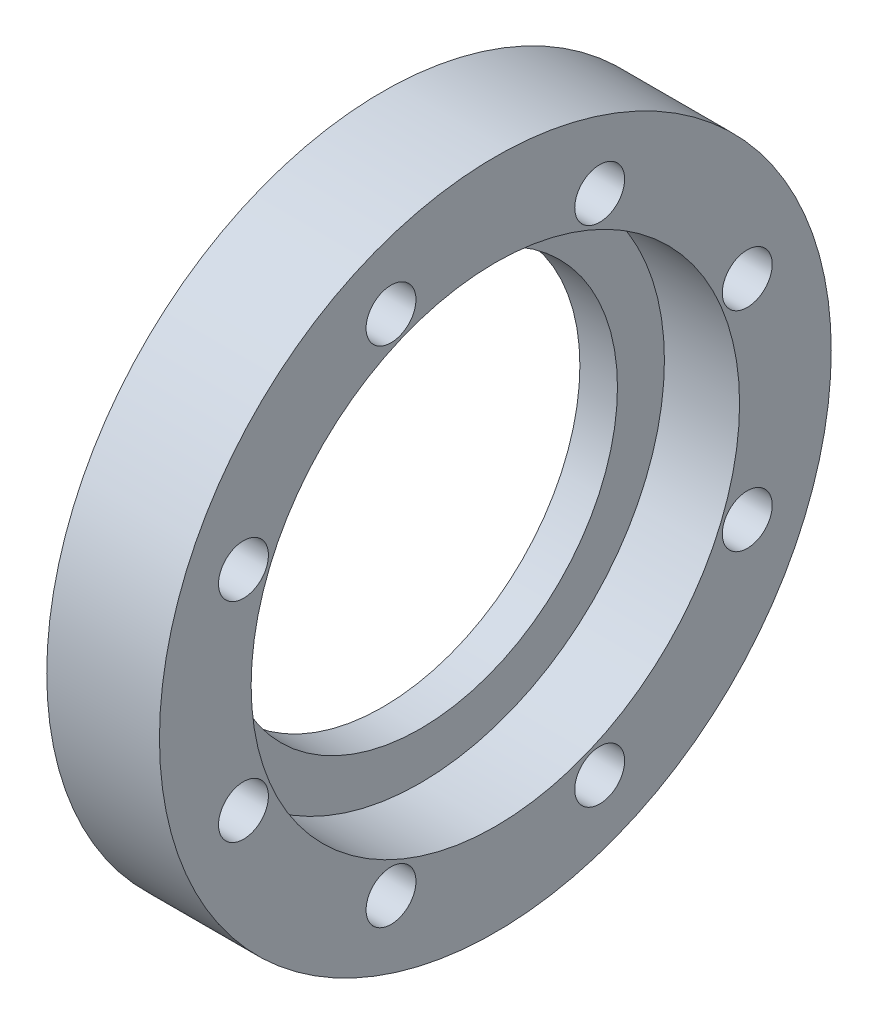
ISO-10303-21;
HEADER;
FILE_DESCRIPTION(('STEP AP214'),'2;1');
FILE_NAME('part.step','',(''),(''),'','','');
FILE_SCHEMA(('AUTOMOTIVE_DESIGN { 1 0 10303 214 1 1 1 1 }'));
ENDSEC;
DATA;
#1=APPLICATION_CONTEXT('core data for automotive mechanical design processes');
#2=APPLICATION_PROTOCOL_DEFINITION('international standard','automotive_design',2000,#1);
#3=PRODUCT_CONTEXT('',#1,'mechanical');
#4=PRODUCT('Part','Part','',(#3));
#5=PRODUCT_RELATED_PRODUCT_CATEGORY('part','',(#4));
#6=PRODUCT_DEFINITION_FORMATION('','',#4);
#7=PRODUCT_DEFINITION_CONTEXT('part definition',#1,'design');
#8=PRODUCT_DEFINITION('design','',#6,#7);
#9=PRODUCT_DEFINITION_SHAPE('','',#8);
#10=(LENGTH_UNIT() NAMED_UNIT(*) SI_UNIT(.MILLI.,.METRE.));
#11=(NAMED_UNIT(*) PLANE_ANGLE_UNIT() SI_UNIT($,.RADIAN.));
#12=(NAMED_UNIT(*) SI_UNIT($,.STERADIAN.) SOLID_ANGLE_UNIT());
#13=UNCERTAINTY_MEASURE_WITH_UNIT(LENGTH_MEASURE(1.E-05),#10,'distance_accuracy_value','');
#14=(GEOMETRIC_REPRESENTATION_CONTEXT(3) GLOBAL_UNCERTAINTY_ASSIGNED_CONTEXT((#13)) GLOBAL_UNIT_ASSIGNED_CONTEXT((#10,
#11,#12)) REPRESENTATION_CONTEXT('',''));
#15=CARTESIAN_POINT('',(0.,0.,0.));
#16=DIRECTION('',(0.,0.,1.));
#17=DIRECTION('',(1.,0.,0.));
#18=AXIS2_PLACEMENT_3D('',#15,#16,#17);
#19=CARTESIAN_POINT('',(6.3499999999999,37.30625,0.));
#20=DIRECTION('',(1.,0.,0.));
#21=DIRECTION('',(0.,0.,-1.));
#22=AXIS2_PLACEMENT_3D('',#19,#20,#21);
#23=PLANE('',#22);
#24=CARTESIAN_POINT('',(6.3499999999999,0.,0.));
#25=DIRECTION('',(1.,0.,0.));
#26=DIRECTION('',(0.,0.,-1.));
#27=AXIS2_PLACEMENT_3D('',#24,#25,#26);
#28=CIRCLE('',#27,33.3375);
#29=CARTESIAN_POINT('',(6.3499999999999,0.,-33.3375));
#30=VERTEX_POINT('',#29);
#31=EDGE_CURVE('E82',#30,#30,#28,.F.);
#32=ORIENTED_EDGE('',*,*,#31,.T.);
#33=EDGE_LOOP('',(#32));
#34=FACE_BOUND('',#33,.T.);
#35=CARTESIAN_POINT('',(6.3499999999999,0.,0.));
#36=DIRECTION('',(1.,0.,0.));
#37=DIRECTION('',(0.,0.,-1.));
#38=AXIS2_PLACEMENT_3D('',#35,#36,#37);
#39=CIRCLE('',#38,41.275);
#40=CARTESIAN_POINT('',(6.3499999999999,0.,-41.275));
#41=VERTEX_POINT('',#40);
#42=EDGE_CURVE('E18',#41,#41,#39,.T.);
#43=ORIENTED_EDGE('',*,*,#42,.T.);
#44=EDGE_LOOP('',(#43));
#45=FACE_BOUND('',#44,.T.);
#46=ADVANCED_FACE('F14',(#34,#45),#23,.T.);
#47=CARTESIAN_POINT('',(12.6999999999999,0.,0.));
#48=DIRECTION('',(1.,0.,0.));
#49=DIRECTION('',(0.,0.,-1.));
#50=AXIS2_PLACEMENT_3D('',#47,#48,#49);
#51=CYLINDRICAL_SURFACE('',#50,41.275);
#52=CARTESIAN_POINT('',(19.05,0.,0.));
#53=DIRECTION('',(1.,0.,0.));
#54=DIRECTION('',(0.,0.,-1.));
#55=AXIS2_PLACEMENT_3D('',#52,#53,#54);
#56=CIRCLE('',#55,41.275);
#57=CARTESIAN_POINT('',(19.05,0.,-41.275));
#58=VERTEX_POINT('',#57);
#59=EDGE_CURVE('E56',#58,#58,#56,.F.);
#60=ORIENTED_EDGE('',*,*,#59,.F.);
#61=EDGE_LOOP('',(#60));
#62=FACE_BOUND('',#61,.T.);
#63=ORIENTED_EDGE('',*,*,#42,.F.);
#64=EDGE_LOOP('',(#63));
#65=FACE_BOUND('',#64,.T.);
#66=ADVANCED_FACE('F90',(#62,#65),#51,.F.);
#67=CARTESIAN_POINT('',(19.05,-42.568303788177,-17.632368756281));
#68=DIRECTION('',(-1.,0.,0.));
#69=DIRECTION('',(0.,0.,1.));
#70=AXIS2_PLACEMENT_3D('',#67,#68,#69);
#71=CYLINDRICAL_SURFACE('',#70,4.2164);
#72=CARTESIAN_POINT('',(19.05,-42.568303788177,-17.632368756281));
#73=DIRECTION('',(-1.,0.,0.));
#74=DIRECTION('',(0.,0.,1.));
#75=AXIS2_PLACEMENT_3D('',#72,#73,#74);
#76=CIRCLE('',#75,4.2164);
#77=CARTESIAN_POINT('',(19.05,-42.568303788177,-13.415968756281));
#78=VERTEX_POINT('',#77);
#79=EDGE_CURVE('E80',#78,#78,#76,.T.);
#80=ORIENTED_EDGE('',*,*,#79,.F.);
#81=EDGE_LOOP('',(#80));
#82=FACE_BOUND('',#81,.T.);
#83=CARTESIAN_POINT('',(0.,-42.568303788177,-17.632368756281));
#84=DIRECTION('',(-1.,0.,0.));
#85=DIRECTION('',(0.,0.,1.));
#86=AXIS2_PLACEMENT_3D('',#83,#84,#85);
#87=CIRCLE('',#86,4.2164);
#88=CARTESIAN_POINT('',(0.,-42.568303788177,-13.415968756281));
#89=VERTEX_POINT('',#88);
#90=EDGE_CURVE('E53',#89,#89,#87,.F.);
#91=ORIENTED_EDGE('',*,*,#90,.F.);
#92=EDGE_LOOP('',(#91));
#93=FACE_BOUND('',#92,.T.);
#94=ADVANCED_FACE('F92',(#82,#93),#71,.F.);
#95=CARTESIAN_POINT('',(19.05,-42.5683037881771,17.6323687562809));
#96=DIRECTION('',(-1.,0.,0.));
#97=DIRECTION('',(0.,0.,1.));
#98=AXIS2_PLACEMENT_3D('',#95,#96,#97);
#99=CYLINDRICAL_SURFACE('',#98,4.2164);
#100=CARTESIAN_POINT('',(19.05,-42.5683037881771,17.6323687562809));
#101=DIRECTION('',(-1.,0.,0.));
#102=DIRECTION('',(0.,0.,1.));
#103=AXIS2_PLACEMENT_3D('',#100,#101,#102);
#104=CIRCLE('',#103,4.2164);
#105=CARTESIAN_POINT('',(19.05,-42.5683037881771,21.8487687562809));
#106=VERTEX_POINT('',#105);
#107=EDGE_CURVE('E77',#106,#106,#104,.T.);
#108=ORIENTED_EDGE('',*,*,#107,.F.);
#109=EDGE_LOOP('',(#108));
#110=FACE_BOUND('',#109,.T.);
#111=CARTESIAN_POINT('',(0.,-42.5683037881771,17.6323687562809));
#112=DIRECTION('',(-1.,0.,0.));
#113=DIRECTION('',(0.,0.,1.));
#114=AXIS2_PLACEMENT_3D('',#111,#112,#113);
#115=CIRCLE('',#114,4.2164);
#116=CARTESIAN_POINT('',(0.,-42.5683037881771,21.8487687562809));
#117=VERTEX_POINT('',#116);
#118=EDGE_CURVE('E50',#117,#117,#115,.F.);
#119=ORIENTED_EDGE('',*,*,#118,.F.);
#120=EDGE_LOOP('',(#119));
#121=FACE_BOUND('',#120,.T.);
#122=ADVANCED_FACE('F100',(#110,#121),#99,.F.);
#123=CARTESIAN_POINT('',(19.05,-17.632368756281,42.568303788177));
#124=DIRECTION('',(-1.,0.,0.));
#125=DIRECTION('',(0.,0.,1.));
#126=AXIS2_PLACEMENT_3D('',#123,#124,#125);
#127=CYLINDRICAL_SURFACE('',#126,4.2164);
#128=CARTESIAN_POINT('',(19.05,-17.632368756281,42.568303788177));
#129=DIRECTION('',(-1.,0.,0.));
#130=DIRECTION('',(0.,0.,1.));
#131=AXIS2_PLACEMENT_3D('',#128,#129,#130);
#132=CIRCLE('',#131,4.2164);
#133=CARTESIAN_POINT('',(19.05,-17.632368756281,46.784703788177));
#134=VERTEX_POINT('',#133);
#135=EDGE_CURVE('E74',#134,#134,#132,.T.);
#136=ORIENTED_EDGE('',*,*,#135,.F.);
#137=EDGE_LOOP('',(#136));
#138=FACE_BOUND('',#137,.T.);
#139=CARTESIAN_POINT('',(0.,-17.632368756281,42.568303788177));
#140=DIRECTION('',(-1.,0.,0.));
#141=DIRECTION('',(0.,0.,1.));
#142=AXIS2_PLACEMENT_3D('',#139,#140,#141);
#143=CIRCLE('',#142,4.2164);
#144=CARTESIAN_POINT('',(0.,-17.632368756281,46.784703788177));
#145=VERTEX_POINT('',#144);
#146=EDGE_CURVE('E47',#145,#145,#143,.F.);
#147=ORIENTED_EDGE('',*,*,#146,.F.);
#148=EDGE_LOOP('',(#147));
#149=FACE_BOUND('',#148,.T.);
#150=ADVANCED_FACE('F150',(#138,#149),#127,.F.);
#151=CARTESIAN_POINT('',(19.05,17.6323687562809,42.5683037881771));
#152=DIRECTION('',(-1.,0.,0.));
#153=DIRECTION('',(0.,0.,1.));
#154=AXIS2_PLACEMENT_3D('',#151,#152,#153);
#155=CYLINDRICAL_SURFACE('',#154,4.2164);
#156=CARTESIAN_POINT('',(19.05,17.6323687562809,42.5683037881771));
#157=DIRECTION('',(-1.,0.,0.));
#158=DIRECTION('',(0.,0.,1.));
#159=AXIS2_PLACEMENT_3D('',#156,#157,#158);
#160=CIRCLE('',#159,4.2164);
#161=CARTESIAN_POINT('',(19.05,17.6323687562809,46.7847037881771));
#162=VERTEX_POINT('',#161);
#163=EDGE_CURVE('E71',#162,#162,#160,.T.);
#164=ORIENTED_EDGE('',*,*,#163,.F.);
#165=EDGE_LOOP('',(#164));
#166=FACE_BOUND('',#165,.T.);
#167=CARTESIAN_POINT('',(0.,17.6323687562809,42.5683037881771));
#168=DIRECTION('',(-1.,0.,0.));
#169=DIRECTION('',(0.,0.,1.));
#170=AXIS2_PLACEMENT_3D('',#167,#168,#169);
#171=CIRCLE('',#170,4.2164);
#172=CARTESIAN_POINT('',(0.,17.6323687562809,46.7847037881771));
#173=VERTEX_POINT('',#172);
#174=EDGE_CURVE('E44',#173,#173,#171,.F.);
#175=ORIENTED_EDGE('',*,*,#174,.F.);
#176=EDGE_LOOP('',(#175));
#177=FACE_BOUND('',#176,.T.);
#178=ADVANCED_FACE('F156',(#166,#177),#155,.F.);
#179=CARTESIAN_POINT('',(19.05,42.568303788177,17.632368756281));
#180=DIRECTION('',(-1.,0.,0.));
#181=DIRECTION('',(0.,0.,1.));
#182=AXIS2_PLACEMENT_3D('',#179,#180,#181);
#183=CYLINDRICAL_SURFACE('',#182,4.2164);
#184=CARTESIAN_POINT('',(19.05,42.568303788177,17.632368756281));
#185=DIRECTION('',(-1.,0.,0.));
#186=DIRECTION('',(0.,0.,1.));
#187=AXIS2_PLACEMENT_3D('',#184,#185,#186);
#188=CIRCLE('',#187,4.2164);
#189=CARTESIAN_POINT('',(19.05,42.568303788177,21.848768756281));
#190=VERTEX_POINT('',#189);
#191=EDGE_CURVE('E68',#190,#190,#188,.T.);
#192=ORIENTED_EDGE('',*,*,#191,.F.);
#193=EDGE_LOOP('',(#192));
#194=FACE_BOUND('',#193,.T.);
#195=CARTESIAN_POINT('',(0.,42.568303788177,17.632368756281));
#196=DIRECTION('',(-1.,0.,0.));
#197=DIRECTION('',(0.,0.,1.));
#198=AXIS2_PLACEMENT_3D('',#195,#196,#197);
#199=CIRCLE('',#198,4.2164);
#200=CARTESIAN_POINT('',(0.,42.568303788177,21.848768756281));
#201=VERTEX_POINT('',#200);
#202=EDGE_CURVE('E41',#201,#201,#199,.F.);
#203=ORIENTED_EDGE('',*,*,#202,.F.);
#204=EDGE_LOOP('',(#203));
#205=FACE_BOUND('',#204,.T.);
#206=ADVANCED_FACE('F163',(#194,#205),#183,.F.);
#207=CARTESIAN_POINT('',(19.05,42.568303788177,-17.6323687562809));
#208=DIRECTION('',(-1.,0.,0.));
#209=DIRECTION('',(0.,0.,1.));
#210=AXIS2_PLACEMENT_3D('',#207,#208,#209);
#211=CYLINDRICAL_SURFACE('',#210,4.21639999999998);
#212=CARTESIAN_POINT('',(19.05,42.568303788177,-17.6323687562809));
#213=DIRECTION('',(-1.,0.,0.));
#214=DIRECTION('',(0.,0.,1.));
#215=AXIS2_PLACEMENT_3D('',#212,#213,#214);
#216=CIRCLE('',#215,4.21639999999998);
#217=CARTESIAN_POINT('',(19.05,42.568303788177,-13.4159687562809));
#218=VERTEX_POINT('',#217);
#219=EDGE_CURVE('E65',#218,#218,#216,.T.);
#220=ORIENTED_EDGE('',*,*,#219,.F.);
#221=EDGE_LOOP('',(#220));
#222=FACE_BOUND('',#221,.T.);
#223=CARTESIAN_POINT('',(0.,42.568303788177,-17.6323687562809));
#224=DIRECTION('',(-1.,0.,0.));
#225=DIRECTION('',(0.,0.,1.));
#226=AXIS2_PLACEMENT_3D('',#223,#224,#225);
#227=CIRCLE('',#226,4.21639999999998);
#228=CARTESIAN_POINT('',(0.,42.568303788177,-13.4159687562809));
#229=VERTEX_POINT('',#228);
#230=EDGE_CURVE('E38',#229,#229,#227,.F.);
#231=ORIENTED_EDGE('',*,*,#230,.F.);
#232=EDGE_LOOP('',(#231));
#233=FACE_BOUND('',#232,.T.);
#234=ADVANCED_FACE('F167',(#222,#233),#211,.F.);
#235=CARTESIAN_POINT('',(19.05,-17.6323687562809,-42.5683037881771));
#236=DIRECTION('',(-1.,0.,0.));
#237=DIRECTION('',(0.,0.,1.));
#238=AXIS2_PLACEMENT_3D('',#235,#236,#237);
#239=CYLINDRICAL_SURFACE('',#238,4.2164);
#240=CARTESIAN_POINT('',(19.05,-17.6323687562809,-42.5683037881771));
#241=DIRECTION('',(-1.,0.,0.));
#242=DIRECTION('',(0.,0.,1.));
#243=AXIS2_PLACEMENT_3D('',#240,#241,#242);
#244=CIRCLE('',#243,4.2164);
#245=CARTESIAN_POINT('',(19.05,-17.6323687562809,-38.3519037881771));
#246=VERTEX_POINT('',#245);
#247=EDGE_CURVE('E62',#246,#246,#244,.T.);
#248=ORIENTED_EDGE('',*,*,#247,.F.);
#249=EDGE_LOOP('',(#248));
#250=FACE_BOUND('',#249,.T.);
#251=CARTESIAN_POINT('',(0.,-17.6323687562809,-42.5683037881771));
#252=DIRECTION('',(-1.,0.,0.));
#253=DIRECTION('',(0.,0.,1.));
#254=AXIS2_PLACEMENT_3D('',#251,#252,#253);
#255=CIRCLE('',#254,4.2164);
#256=CARTESIAN_POINT('',(0.,-17.6323687562809,-38.3519037881771));
#257=VERTEX_POINT('',#256);
#258=EDGE_CURVE('E35',#257,#257,#255,.F.);
#259=ORIENTED_EDGE('',*,*,#258,.F.);
#260=EDGE_LOOP('',(#259));
#261=FACE_BOUND('',#260,.T.);
#262=ADVANCED_FACE('F126',(#250,#261),#239,.F.);
#263=CARTESIAN_POINT('',(19.05,17.632368756281,-42.568303788177));
#264=DIRECTION('',(-1.,0.,0.));
#265=DIRECTION('',(0.,0.,1.));
#266=AXIS2_PLACEMENT_3D('',#263,#264,#265);
#267=CYLINDRICAL_SURFACE('',#266,4.2164);
#268=CARTESIAN_POINT('',(19.05,17.632368756281,-42.568303788177));
#269=DIRECTION('',(-1.,0.,0.));
#270=DIRECTION('',(0.,0.,1.));
#271=AXIS2_PLACEMENT_3D('',#268,#269,#270);
#272=CIRCLE('',#271,4.2164);
#273=CARTESIAN_POINT('',(19.05,17.632368756281,-38.351903788177));
#274=VERTEX_POINT('',#273);
#275=EDGE_CURVE('E59',#274,#274,#272,.T.);
#276=ORIENTED_EDGE('',*,*,#275,.F.);
#277=EDGE_LOOP('',(#276));
#278=FACE_BOUND('',#277,.T.);
#279=CARTESIAN_POINT('',(0.,17.632368756281,-42.568303788177));
#280=DIRECTION('',(-1.,0.,0.));
#281=DIRECTION('',(0.,0.,1.));
#282=AXIS2_PLACEMENT_3D('',#279,#280,#281);
#283=CIRCLE('',#282,4.2164);
#284=CARTESIAN_POINT('',(0.,17.632368756281,-38.351903788177));
#285=VERTEX_POINT('',#284);
#286=EDGE_CURVE('E32',#285,#285,#283,.F.);
#287=ORIENTED_EDGE('',*,*,#286,.F.);
#288=EDGE_LOOP('',(#287));
#289=FACE_BOUND('',#288,.T.);
#290=ADVANCED_FACE('F16',(#278,#289),#267,.F.);
#291=CARTESIAN_POINT('',(3.17499999999992,0.,0.));
#292=DIRECTION('',(1.,0.,0.));
#293=DIRECTION('',(0.,0.,-1.));
#294=AXIS2_PLACEMENT_3D('',#291,#292,#293);
#295=CYLINDRICAL_SURFACE('',#294,33.3375);
#296=ORIENTED_EDGE('',*,*,#31,.F.);
#297=EDGE_LOOP('',(#296));
#298=FACE_BOUND('',#297,.T.);
#299=CARTESIAN_POINT('',(0.,0.,0.));
#300=DIRECTION('',(1.,0.,0.));
#301=DIRECTION('',(0.,0.,-1.));
#302=AXIS2_PLACEMENT_3D('',#299,#300,#301);
#303=CIRCLE('',#302,33.3375);
#304=CARTESIAN_POINT('',(0.,0.,-33.3375));
#305=VERTEX_POINT('',#304);
#306=EDGE_CURVE('E27',#305,#305,#303,.T.);
#307=ORIENTED_EDGE('',*,*,#306,.F.);
#308=EDGE_LOOP('',(#307));
#309=FACE_BOUND('',#308,.T.);
#310=ADVANCED_FACE('F119',(#298,#309),#295,.F.);
#311=CARTESIAN_POINT('',(19.05,49.0219999999995,0.));
#312=DIRECTION('',(1.,0.,0.));
#313=DIRECTION('',(0.,0.,-1.));
#314=AXIS2_PLACEMENT_3D('',#311,#312,#313);
#315=PLANE('',#314);
#316=ORIENTED_EDGE('',*,*,#59,.T.);
#317=EDGE_LOOP('',(#316));
#318=FACE_BOUND('',#317,.T.);
#319=ORIENTED_EDGE('',*,*,#275,.T.);
#320=EDGE_LOOP('',(#319));
#321=FACE_BOUND('',#320,.T.);
#322=ORIENTED_EDGE('',*,*,#247,.T.);
#323=EDGE_LOOP('',(#322));
#324=FACE_BOUND('',#323,.T.);
#325=ORIENTED_EDGE('',*,*,#219,.T.);
#326=EDGE_LOOP('',(#325));
#327=FACE_BOUND('',#326,.T.);
#328=ORIENTED_EDGE('',*,*,#191,.T.);
#329=EDGE_LOOP('',(#328));
#330=FACE_BOUND('',#329,.T.);
#331=ORIENTED_EDGE('',*,*,#163,.T.);
#332=EDGE_LOOP('',(#331));
#333=FACE_BOUND('',#332,.T.);
#334=ORIENTED_EDGE('',*,*,#135,.T.);
#335=EDGE_LOOP('',(#334));
#336=FACE_BOUND('',#335,.T.);
#337=ORIENTED_EDGE('',*,*,#107,.T.);
#338=EDGE_LOOP('',(#337));
#339=FACE_BOUND('',#338,.T.);
#340=ORIENTED_EDGE('',*,*,#79,.T.);
#341=EDGE_LOOP('',(#340));
#342=FACE_BOUND('',#341,.T.);
#343=CARTESIAN_POINT('',(19.0500000000001,0.,0.));
#344=DIRECTION('',(1.,0.,0.));
#345=DIRECTION('',(0.,0.,-1.));
#346=AXIS2_PLACEMENT_3D('',#343,#344,#345);
#347=CIRCLE('',#346,56.7689999999989);
#348=CARTESIAN_POINT('',(19.0500000000001,0.,-56.7689999999989));
#349=VERTEX_POINT('',#348);
#350=EDGE_CURVE('E22',#349,#349,#347,.F.);
#351=ORIENTED_EDGE('',*,*,#350,.F.);
#352=EDGE_LOOP('',(#351));
#353=FACE_BOUND('',#352,.T.);
#354=ADVANCED_FACE('F113',(#318,#321,#324,#327,#330,#333,#336,#339,#342,#353),#315,.T.);
#355=CARTESIAN_POINT('',(0.,45.0532499999995,0.));
#356=DIRECTION('',(-1.,0.,0.));
#357=DIRECTION('',(0.,0.,1.));
#358=AXIS2_PLACEMENT_3D('',#355,#356,#357);
#359=PLANE('',#358);
#360=ORIENTED_EDGE('',*,*,#306,.T.);
#361=EDGE_LOOP('',(#360));
#362=FACE_BOUND('',#361,.T.);
#363=ORIENTED_EDGE('',*,*,#286,.T.);
#364=EDGE_LOOP('',(#363));
#365=FACE_BOUND('',#364,.T.);
#366=ORIENTED_EDGE('',*,*,#258,.T.);
#367=EDGE_LOOP('',(#366));
#368=FACE_BOUND('',#367,.T.);
#369=ORIENTED_EDGE('',*,*,#230,.T.);
#370=EDGE_LOOP('',(#369));
#371=FACE_BOUND('',#370,.T.);
#372=ORIENTED_EDGE('',*,*,#202,.T.);
#373=EDGE_LOOP('',(#372));
#374=FACE_BOUND('',#373,.T.);
#375=ORIENTED_EDGE('',*,*,#174,.T.);
#376=EDGE_LOOP('',(#375));
#377=FACE_BOUND('',#376,.T.);
#378=ORIENTED_EDGE('',*,*,#146,.T.);
#379=EDGE_LOOP('',(#378));
#380=FACE_BOUND('',#379,.T.);
#381=ORIENTED_EDGE('',*,*,#118,.T.);
#382=EDGE_LOOP('',(#381));
#383=FACE_BOUND('',#382,.T.);
#384=ORIENTED_EDGE('',*,*,#90,.T.);
#385=EDGE_LOOP('',(#384));
#386=FACE_BOUND('',#385,.T.);
#387=CARTESIAN_POINT('',(0.,0.,0.));
#388=DIRECTION('',(1.,0.,0.));
#389=DIRECTION('',(0.,0.,-1.));
#390=AXIS2_PLACEMENT_3D('',#387,#388,#389);
#391=CIRCLE('',#390,56.7689999999989);
#392=CARTESIAN_POINT('',(0.,0.,-56.7689999999989));
#393=VERTEX_POINT('',#392);
#394=EDGE_CURVE('E10',#393,#393,#391,.T.);
#395=ORIENTED_EDGE('',*,*,#394,.F.);
#396=EDGE_LOOP('',(#395));
#397=FACE_BOUND('',#396,.T.);
#398=ADVANCED_FACE('F108',(#362,#365,#368,#371,#374,#377,#380,#383,#386,#397),#359,.T.);
#399=CARTESIAN_POINT('',(9.52500000000005,0.,0.));
#400=DIRECTION('',(1.,0.,0.));
#401=DIRECTION('',(0.,0.,-1.));
#402=AXIS2_PLACEMENT_3D('',#399,#400,#401);
#403=CYLINDRICAL_SURFACE('',#402,56.7689999999989);
#404=ORIENTED_EDGE('',*,*,#394,.T.);
#405=EDGE_LOOP('',(#404));
#406=FACE_BOUND('',#405,.T.);
#407=ORIENTED_EDGE('',*,*,#350,.T.);
#408=EDGE_LOOP('',(#407));
#409=FACE_BOUND('',#408,.T.);
#410=ADVANCED_FACE('F106',(#406,#409),#403,.T.);
#411=CLOSED_SHELL('',(#46,#66,#94,#122,#150,#178,#206,#234,#262,#290,#310,#354,#398,#410));
#412=MANIFOLD_SOLID_BREP('B1',#411);
#413=ADVANCED_BREP_SHAPE_REPRESENTATION('',(#18,#412),#14);
#414=SHAPE_DEFINITION_REPRESENTATION(#9,#413);
ENDSEC;
END-ISO-10303-21;
